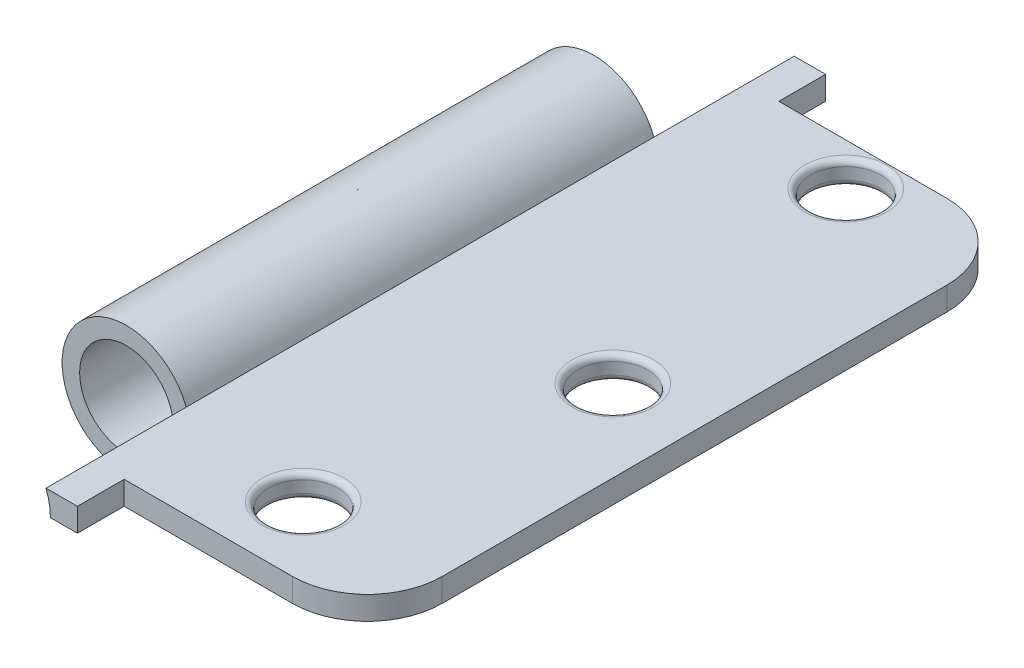
ISO-10303-21;
HEADER;
FILE_DESCRIPTION(('STEP AP214'),'2;1');
FILE_NAME('part.step','',(''),(''),'','','');
FILE_SCHEMA(('AUTOMOTIVE_DESIGN { 1 0 10303 214 1 1 1 1 }'));
ENDSEC;
DATA;
#1=APPLICATION_CONTEXT('core data for automotive mechanical design processes');
#2=APPLICATION_PROTOCOL_DEFINITION('international standard','automotive_design',2000,#1);
#3=PRODUCT_CONTEXT('',#1,'mechanical');
#4=PRODUCT('Part','Part','',(#3));
#5=PRODUCT_RELATED_PRODUCT_CATEGORY('part','',(#4));
#6=PRODUCT_DEFINITION_FORMATION('','',#4);
#7=PRODUCT_DEFINITION_CONTEXT('part definition',#1,'design');
#8=PRODUCT_DEFINITION('design','',#6,#7);
#9=PRODUCT_DEFINITION_SHAPE('','',#8);
#10=(LENGTH_UNIT() NAMED_UNIT(*) SI_UNIT(.MILLI.,.METRE.));
#11=(NAMED_UNIT(*) PLANE_ANGLE_UNIT() SI_UNIT($,.RADIAN.));
#12=(NAMED_UNIT(*) SI_UNIT($,.STERADIAN.) SOLID_ANGLE_UNIT());
#13=UNCERTAINTY_MEASURE_WITH_UNIT(LENGTH_MEASURE(1.E-05),#10,'distance_accuracy_value','');
#14=(GEOMETRIC_REPRESENTATION_CONTEXT(3) GLOBAL_UNCERTAINTY_ASSIGNED_CONTEXT((#13)) GLOBAL_UNIT_ASSIGNED_CONTEXT((#10,
#11,#12)) REPRESENTATION_CONTEXT('',''));
#15=CARTESIAN_POINT('',(0.,0.,0.));
#16=DIRECTION('',(0.,0.,1.));
#17=DIRECTION('',(1.,0.,0.));
#18=AXIS2_PLACEMENT_3D('',#15,#16,#17);
#19=CARTESIAN_POINT('',(-11.9822044674469,0.,50.8));
#20=DIRECTION('',(0.,0.,-1.));
#21=DIRECTION('',(-1.,0.,0.));
#22=AXIS2_PLACEMENT_3D('',#19,#20,#21);
#23=CYLINDRICAL_SURFACE('',#22,8.73125);
#24=CARTESIAN_POINT('',(-11.9822044674468,0.,-31.75));
#25=DIRECTION('',(0.,0.,-1.));
#26=DIRECTION('',(-1.,0.,0.));
#27=AXIS2_PLACEMENT_3D('',#24,#25,#26);
#28=CIRCLE('',#27,8.73124999999996);
#29=CARTESIAN_POINT('',(-3.25095446744689,0.,-31.75));
#30=VERTEX_POINT('',#29);
#31=CARTESIAN_POINT('',(-3.84868729696646,3.175,-31.75));
#32=VERTEX_POINT('',#31);
#33=EDGE_CURVE('E171',#30,#32,#28,.T.);
#34=ORIENTED_EDGE('',*,*,#33,.F.);
#35=DIRECTION('',(0.,0.,-1.));
#36=VECTOR('',#35,1.);
#37=CARTESIAN_POINT('',(-3.25095446744686,0.,50.8));
#38=LINE('',#37,#36);
#39=CARTESIAN_POINT('',(-3.25095446744686,0.,31.75));
#40=VERTEX_POINT('',#39);
#41=EDGE_CURVE('E193',#40,#30,#38,.T.);
#42=ORIENTED_EDGE('',*,*,#41,.F.);
#43=CARTESIAN_POINT('',(-11.9822044674469,0.,31.75));
#44=DIRECTION('',(0.,0.,1.));
#45=DIRECTION('',(1.,0.,0.));
#46=AXIS2_PLACEMENT_3D('',#43,#44,#45);
#47=CIRCLE('',#46,8.73125);
#48=CARTESIAN_POINT('',(-3.84868729696643,3.175,31.75));
#49=VERTEX_POINT('',#48);
#50=EDGE_CURVE('E184',#49,#40,#47,.T.);
#51=ORIENTED_EDGE('',*,*,#50,.F.);
#52=DIRECTION('',(0.,0.,-1.));
#53=VECTOR('',#52,1.);
#54=CARTESIAN_POINT('',(-3.84868729696643,3.175,50.8));
#55=LINE('',#54,#53);
#56=EDGE_CURVE('E190',#49,#32,#55,.T.);
#57=ORIENTED_EDGE('',*,*,#56,.T.);
#58=EDGE_LOOP('',(#34,#42,#51,#57));
#59=FACE_BOUND('',#58,.T.);
#60=ADVANCED_FACE('F42',(#59),#23,.T.);
#61=CARTESIAN_POINT('',(-11.9822044674469,0.,50.8));
#62=DIRECTION('',(0.,0.,-1.));
#63=DIRECTION('',(-1.,0.,0.));
#64=AXIS2_PLACEMENT_3D('',#61,#62,#63);
#65=CYLINDRICAL_SURFACE('',#64,6.35);
#66=CARTESIAN_POINT('',(-11.9822044674469,0.,31.75));
#67=DIRECTION('',(0.,0.,1.));
#68=DIRECTION('',(1.,0.,0.));
#69=AXIS2_PLACEMENT_3D('',#66,#67,#68);
#70=CIRCLE('',#69,6.35);
#71=CARTESIAN_POINT('',(-5.63220446744686,0.,31.75));
#72=VERTEX_POINT('',#71);
#73=EDGE_CURVE('E183',#72,#72,#70,.T.);
#74=ORIENTED_EDGE('',*,*,#73,.T.);
#75=EDGE_LOOP('',(#74));
#76=FACE_BOUND('',#75,.T.);
#77=CARTESIAN_POINT('',(-11.9822044674469,0.,-31.75));
#78=DIRECTION('',(0.,0.,-1.));
#79=DIRECTION('',(-1.,0.,0.));
#80=AXIS2_PLACEMENT_3D('',#77,#78,#79);
#81=CIRCLE('',#80,6.35);
#82=CARTESIAN_POINT('',(-18.3322044674469,0.,-31.75));
#83=VERTEX_POINT('',#82);
#84=EDGE_CURVE('E177',#83,#83,#81,.T.);
#85=ORIENTED_EDGE('',*,*,#84,.T.);
#86=EDGE_LOOP('',(#85));
#87=FACE_BOUND('',#86,.T.);
#88=ADVANCED_FACE('F291',(#76,#87),#65,.F.);
#89=CARTESIAN_POINT('',(23.273512,3.175,34.29));
#90=DIRECTION('',(0.,1.,0.));
#91=DIRECTION('',(0.,0.,1.));
#92=AXIS2_PLACEMENT_3D('',#89,#90,#91);
#93=PLANE('',#92);
#94=DIRECTION('',(-1.,0.,0.));
#95=VECTOR('',#94,1.);
#96=CARTESIAN_POINT('',(23.273512,3.175,-44.45));
#97=LINE('',#96,#95);
#98=CARTESIAN_POINT('',(23.273512,3.175,-44.45));
#99=VERTEX_POINT('',#98);
#100=CARTESIAN_POINT('',(0.413486599999999,3.175,-44.45));
#101=VERTEX_POINT('',#100);
#102=EDGE_CURVE('E204',#99,#101,#97,.T.);
#103=ORIENTED_EDGE('',*,*,#102,.T.);
#104=DIRECTION('',(0.,0.,1.));
#105=VECTOR('',#104,1.);
#106=CARTESIAN_POINT('',(0.4134866,3.175,-54.0018113886329));
#107=LINE('',#106,#105);
#108=CARTESIAN_POINT('',(0.4134866,3.175,-50.8));
#109=VERTEX_POINT('',#108);
#110=EDGE_CURVE('E161',#109,#101,#107,.T.);
#111=ORIENTED_EDGE('',*,*,#110,.F.);
#112=DIRECTION('',(1.,0.,0.));
#113=VECTOR('',#112,1.);
#114=CARTESIAN_POINT('',(0.,3.175,-50.8));
#115=LINE('',#114,#113);
#116=CARTESIAN_POINT('',(-3.84868729696643,3.175,-50.8));
#117=VERTEX_POINT('',#116);
#118=EDGE_CURVE('E141',#117,#109,#115,.T.);
#119=ORIENTED_EDGE('',*,*,#118,.F.);
#120=DIRECTION('',(0.,0.,-1.));
#121=VECTOR('',#120,1.);
#122=CARTESIAN_POINT('',(-3.84868729696646,3.175,-31.75));
#123=LINE('',#122,#121);
#124=EDGE_CURVE('E175',#32,#117,#123,.T.);
#125=ORIENTED_EDGE('',*,*,#124,.F.);
#126=ORIENTED_EDGE('',*,*,#56,.F.);
#127=CARTESIAN_POINT('',(-3.84868729696643,3.175,50.8));
#128=VERTEX_POINT('',#127);
#129=EDGE_CURVE('E191',#128,#49,#55,.T.);
#130=ORIENTED_EDGE('',*,*,#129,.F.);
#131=DIRECTION('',(-1.,0.,0.));
#132=VECTOR('',#131,1.);
#133=CARTESIAN_POINT('',(0.,3.175,50.8));
#134=LINE('',#133,#132);
#135=CARTESIAN_POINT('',(0.4134866,3.175,50.8));
#136=VERTEX_POINT('',#135);
#137=EDGE_CURVE('E140',#136,#128,#134,.T.);
#138=ORIENTED_EDGE('',*,*,#137,.F.);
#139=CARTESIAN_POINT('',(0.4134866,3.175,44.45));
#140=VERTEX_POINT('',#139);
#141=EDGE_CURVE('E156',#140,#136,#107,.T.);
#142=ORIENTED_EDGE('',*,*,#141,.F.);
#143=DIRECTION('',(1.,0.,0.));
#144=VECTOR('',#143,1.);
#145=CARTESIAN_POINT('',(0.,3.175,44.45));
#146=LINE('',#145,#144);
#147=CARTESIAN_POINT('',(23.273512,3.175,44.45));
#148=VERTEX_POINT('',#147);
#149=EDGE_CURVE('E206',#140,#148,#146,.T.);
#150=ORIENTED_EDGE('',*,*,#149,.T.);
#151=CARTESIAN_POINT('',(23.273512,3.175,34.29));
#152=DIRECTION('',(0.,1.,0.));
#153=DIRECTION('',(0.,0.,1.));
#154=AXIS2_PLACEMENT_3D('',#151,#152,#153);
#155=CIRCLE('',#154,10.16);
#156=CARTESIAN_POINT('',(33.433512,3.175,34.29));
#157=VERTEX_POINT('',#156);
#158=EDGE_CURVE('E197',#148,#157,#155,.T.);
#159=ORIENTED_EDGE('',*,*,#158,.T.);
#160=DIRECTION('',(0.,0.,-1.));
#161=VECTOR('',#160,1.);
#162=CARTESIAN_POINT('',(33.433512,3.175,34.29));
#163=LINE('',#162,#161);
#164=CARTESIAN_POINT('',(33.433512,3.175,-34.29));
#165=VERTEX_POINT('',#164);
#166=EDGE_CURVE('E200',#157,#165,#163,.T.);
#167=ORIENTED_EDGE('',*,*,#166,.T.);
#168=CARTESIAN_POINT('',(23.273512,3.175,-34.29));
#169=DIRECTION('',(0.,1.,0.));
#170=DIRECTION('',(0.,0.,1.));
#171=AXIS2_PLACEMENT_3D('',#168,#169,#170);
#172=CIRCLE('',#171,10.16);
#173=EDGE_CURVE('E202',#165,#99,#172,.T.);
#174=ORIENTED_EDGE('',*,*,#173,.T.);
#175=EDGE_LOOP('',(#103,#111,#119,#125,#126,#130,#138,#142,#150,#159,#167,#174));
#176=FACE_BOUND('',#175,.T.);
#177=CARTESIAN_POINT('',(22.321012,3.175,0.));
#178=DIRECTION('',(0.,1.,0.));
#179=DIRECTION('',(0.,0.,1.));
#180=AXIS2_PLACEMENT_3D('',#177,#178,#179);
#181=CIRCLE('',#180,5.55625);
#182=CARTESIAN_POINT('',(22.321012,3.175,5.55625));
#183=VERTEX_POINT('',#182);
#184=EDGE_CURVE('E50',#183,#183,#181,.F.);
#185=ORIENTED_EDGE('',*,*,#184,.T.);
#186=EDGE_LOOP('',(#185));
#187=FACE_BOUND('',#186,.T.);
#188=CARTESIAN_POINT('',(15.209012,3.175,-38.735));
#189=DIRECTION('',(0.,1.,0.));
#190=DIRECTION('',(0.,0.,1.));
#191=AXIS2_PLACEMENT_3D('',#188,#189,#190);
#192=CIRCLE('',#191,5.55625000000001);
#193=CARTESIAN_POINT('',(15.209012,3.175,-33.17875));
#194=VERTEX_POINT('',#193);
#195=EDGE_CURVE('E259',#194,#194,#192,.F.);
#196=ORIENTED_EDGE('',*,*,#195,.T.);
#197=EDGE_LOOP('',(#196));
#198=FACE_BOUND('',#197,.T.);
#199=CARTESIAN_POINT('',(15.209012,3.175,34.925));
#200=DIRECTION('',(0.,1.,0.));
#201=DIRECTION('',(0.,0.,1.));
#202=AXIS2_PLACEMENT_3D('',#199,#200,#201);
#203=CIRCLE('',#202,5.55625000000001);
#204=CARTESIAN_POINT('',(15.209012,3.175,40.48125));
#205=VERTEX_POINT('',#204);
#206=EDGE_CURVE('E256',#205,#205,#203,.F.);
#207=ORIENTED_EDGE('',*,*,#206,.T.);
#208=EDGE_LOOP('',(#207));
#209=FACE_BOUND('',#208,.T.);
#210=ADVANCED_FACE('F264',(#176,#187,#198,#209),#93,.T.);
#211=CARTESIAN_POINT('',(23.273512,0.,34.29));
#212=DIRECTION('',(0.,1.,0.));
#213=DIRECTION('',(0.,0.,1.));
#214=AXIS2_PLACEMENT_3D('',#211,#212,#213);
#215=PLANE('',#214);
#216=CARTESIAN_POINT('',(15.209012,0.,34.925));
#217=DIRECTION('',(0.,1.,0.));
#218=DIRECTION('',(0.,0.,1.));
#219=AXIS2_PLACEMENT_3D('',#216,#217,#218);
#220=CIRCLE('',#219,5.55625000000001);
#221=CARTESIAN_POINT('',(15.209012,0.,40.48125));
#222=VERTEX_POINT('',#221);
#223=EDGE_CURVE('E235',#222,#222,#220,.T.);
#224=ORIENTED_EDGE('',*,*,#223,.T.);
#225=EDGE_LOOP('',(#224));
#226=FACE_BOUND('',#225,.T.);
#227=CARTESIAN_POINT('',(15.209012,0.,-38.735));
#228=DIRECTION('',(0.,1.,0.));
#229=DIRECTION('',(0.,0.,1.));
#230=AXIS2_PLACEMENT_3D('',#227,#228,#229);
#231=CIRCLE('',#230,5.55625000000001);
#232=CARTESIAN_POINT('',(15.209012,0.,-33.17875));
#233=VERTEX_POINT('',#232);
#234=EDGE_CURVE('E232',#233,#233,#231,.T.);
#235=ORIENTED_EDGE('',*,*,#234,.T.);
#236=EDGE_LOOP('',(#235));
#237=FACE_BOUND('',#236,.T.);
#238=CARTESIAN_POINT('',(22.321012,0.,0.));
#239=DIRECTION('',(0.,1.,0.));
#240=DIRECTION('',(0.,0.,1.));
#241=AXIS2_PLACEMENT_3D('',#238,#239,#240);
#242=CIRCLE('',#241,5.55625);
#243=CARTESIAN_POINT('',(22.321012,0.,5.55625));
#244=VERTEX_POINT('',#243);
#245=EDGE_CURVE('E227',#244,#244,#242,.T.);
#246=ORIENTED_EDGE('',*,*,#245,.T.);
#247=EDGE_LOOP('',(#246));
#248=FACE_BOUND('',#247,.T.);
#249=DIRECTION('',(1.,0.,0.));
#250=VECTOR('',#249,1.);
#251=CARTESIAN_POINT('',(0.,0.,44.45));
#252=LINE('',#251,#250);
#253=CARTESIAN_POINT('',(0.4134866,0.,44.45));
#254=VERTEX_POINT('',#253);
#255=CARTESIAN_POINT('',(23.273512,0.,44.45));
#256=VERTEX_POINT('',#255);
#257=EDGE_CURVE('E148',#254,#256,#252,.T.);
#258=ORIENTED_EDGE('',*,*,#257,.F.);
#259=DIRECTION('',(0.,0.,1.));
#260=VECTOR('',#259,1.);
#261=CARTESIAN_POINT('',(0.4134866,0.,-54.0018113886329));
#262=LINE('',#261,#260);
#263=CARTESIAN_POINT('',(0.4134866,0.,50.8));
#264=VERTEX_POINT('',#263);
#265=EDGE_CURVE('E145',#254,#264,#262,.T.);
#266=ORIENTED_EDGE('',*,*,#265,.T.);
#267=DIRECTION('',(-1.,0.,0.));
#268=VECTOR('',#267,1.);
#269=CARTESIAN_POINT('',(0.,0.,50.8));
#270=LINE('',#269,#268);
#271=CARTESIAN_POINT('',(-3.25095446744686,0.,50.8));
#272=VERTEX_POINT('',#271);
#273=EDGE_CURVE('E131',#264,#272,#270,.T.);
#274=ORIENTED_EDGE('',*,*,#273,.T.);
#275=EDGE_CURVE('E194',#272,#40,#38,.T.);
#276=ORIENTED_EDGE('',*,*,#275,.T.);
#277=ORIENTED_EDGE('',*,*,#41,.T.);
#278=DIRECTION('',(0.,0.,-1.));
#279=VECTOR('',#278,1.);
#280=CARTESIAN_POINT('',(-3.25095446744689,0.,-31.75));
#281=LINE('',#280,#279);
#282=CARTESIAN_POINT('',(-3.2509544674469,0.,-50.8));
#283=VERTEX_POINT('',#282);
#284=EDGE_CURVE('E170',#30,#283,#281,.T.);
#285=ORIENTED_EDGE('',*,*,#284,.T.);
#286=DIRECTION('',(1.,0.,0.));
#287=VECTOR('',#286,1.);
#288=CARTESIAN_POINT('',(0.,0.,-50.8));
#289=LINE('',#288,#287);
#290=CARTESIAN_POINT('',(0.4134866,0.,-50.8));
#291=VERTEX_POINT('',#290);
#292=EDGE_CURVE('E187',#283,#291,#289,.T.);
#293=ORIENTED_EDGE('',*,*,#292,.T.);
#294=CARTESIAN_POINT('',(0.413486599999999,0.,-44.45));
#295=VERTEX_POINT('',#294);
#296=EDGE_CURVE('E151',#291,#295,#262,.T.);
#297=ORIENTED_EDGE('',*,*,#296,.T.);
#298=DIRECTION('',(-1.,0.,0.));
#299=VECTOR('',#298,1.);
#300=CARTESIAN_POINT('',(23.273512,0.,-44.45));
#301=LINE('',#300,#299);
#302=CARTESIAN_POINT('',(23.273512,0.,-44.45));
#303=VERTEX_POINT('',#302);
#304=EDGE_CURVE('E62',#303,#295,#301,.T.);
#305=ORIENTED_EDGE('',*,*,#304,.F.);
#306=CARTESIAN_POINT('',(23.273512,0.,-34.29));
#307=DIRECTION('',(0.,1.,0.));
#308=DIRECTION('',(0.,0.,1.));
#309=AXIS2_PLACEMENT_3D('',#306,#307,#308);
#310=CIRCLE('',#309,10.16);
#311=CARTESIAN_POINT('',(33.433512,0.,-34.29));
#312=VERTEX_POINT('',#311);
#313=EDGE_CURVE('E213',#312,#303,#310,.T.);
#314=ORIENTED_EDGE('',*,*,#313,.F.);
#315=DIRECTION('',(0.,0.,-1.));
#316=VECTOR('',#315,1.);
#317=CARTESIAN_POINT('',(33.433512,0.,34.29));
#318=LINE('',#317,#316);
#319=CARTESIAN_POINT('',(33.433512,0.,34.29));
#320=VERTEX_POINT('',#319);
#321=EDGE_CURVE('E211',#320,#312,#318,.T.);
#322=ORIENTED_EDGE('',*,*,#321,.F.);
#323=CARTESIAN_POINT('',(23.273512,0.,34.29));
#324=DIRECTION('',(0.,1.,0.));
#325=DIRECTION('',(0.,0.,1.));
#326=AXIS2_PLACEMENT_3D('',#323,#324,#325);
#327=CIRCLE('',#326,10.16);
#328=EDGE_CURVE('E196',#256,#320,#327,.T.);
#329=ORIENTED_EDGE('',*,*,#328,.F.);
#330=EDGE_LOOP('',(#258,#266,#274,#276,#277,#285,#293,#297,#305,#314,#322,#329));
#331=FACE_BOUND('',#330,.T.);
#332=ADVANCED_FACE('F146',(#226,#237,#248,#331),#215,.F.);
#333=CARTESIAN_POINT('',(23.273512,3.175,34.29));
#334=DIRECTION('',(0.,-1.,0.));
#335=DIRECTION('',(0.,0.,-1.));
#336=AXIS2_PLACEMENT_3D('',#333,#334,#335);
#337=CYLINDRICAL_SURFACE('',#336,10.16);
#338=ORIENTED_EDGE('',*,*,#328,.T.);
#339=DIRECTION('',(0.,-1.,0.));
#340=VECTOR('',#339,1.);
#341=CARTESIAN_POINT('',(33.433512,3.175,34.29));
#342=LINE('',#341,#340);
#343=EDGE_CURVE('E224',#157,#320,#342,.T.);
#344=ORIENTED_EDGE('',*,*,#343,.F.);
#345=ORIENTED_EDGE('',*,*,#158,.F.);
#346=DIRECTION('',(0.,-1.,0.));
#347=VECTOR('',#346,1.);
#348=CARTESIAN_POINT('',(23.273512,3.175,44.45));
#349=LINE('',#348,#347);
#350=EDGE_CURVE('E208',#148,#256,#349,.T.);
#351=ORIENTED_EDGE('',*,*,#350,.T.);
#352=EDGE_LOOP('',(#338,#344,#345,#351));
#353=FACE_BOUND('',#352,.T.);
#354=ADVANCED_FACE('F350',(#353),#337,.T.);
#355=CARTESIAN_POINT('',(33.433512,3.175,34.29));
#356=DIRECTION('',(-1.,0.,0.));
#357=DIRECTION('',(0.,0.,1.));
#358=AXIS2_PLACEMENT_3D('',#355,#356,#357);
#359=PLANE('',#358);
#360=ORIENTED_EDGE('',*,*,#321,.T.);
#361=DIRECTION('',(0.,-1.,0.));
#362=VECTOR('',#361,1.);
#363=CARTESIAN_POINT('',(33.433512,3.175,-34.29));
#364=LINE('',#363,#362);
#365=EDGE_CURVE('E221',#165,#312,#364,.T.);
#366=ORIENTED_EDGE('',*,*,#365,.F.);
#367=ORIENTED_EDGE('',*,*,#166,.F.);
#368=ORIENTED_EDGE('',*,*,#343,.T.);
#369=EDGE_LOOP('',(#360,#366,#367,#368));
#370=FACE_BOUND('',#369,.T.);
#371=ADVANCED_FACE('F347',(#370),#359,.F.);
#372=CARTESIAN_POINT('',(23.273512,3.175,-34.29));
#373=DIRECTION('',(0.,-1.,0.));
#374=DIRECTION('',(0.,0.,-1.));
#375=AXIS2_PLACEMENT_3D('',#372,#373,#374);
#376=CYLINDRICAL_SURFACE('',#375,10.16);
#377=ORIENTED_EDGE('',*,*,#313,.T.);
#378=DIRECTION('',(0.,-1.,0.));
#379=VECTOR('',#378,1.);
#380=CARTESIAN_POINT('',(23.273512,3.175,-44.45));
#381=LINE('',#380,#379);
#382=EDGE_CURVE('E219',#99,#303,#381,.T.);
#383=ORIENTED_EDGE('',*,*,#382,.F.);
#384=ORIENTED_EDGE('',*,*,#173,.F.);
#385=ORIENTED_EDGE('',*,*,#365,.T.);
#386=EDGE_LOOP('',(#377,#383,#384,#385));
#387=FACE_BOUND('',#386,.T.);
#388=ADVANCED_FACE('F343',(#387),#376,.T.);
#389=CARTESIAN_POINT('',(23.273512,3.175,-44.45));
#390=DIRECTION('',(0.,0.,1.));
#391=DIRECTION('',(1.,0.,0.));
#392=AXIS2_PLACEMENT_3D('',#389,#390,#391);
#393=PLANE('',#392);
#394=ORIENTED_EDGE('',*,*,#304,.T.);
#395=DIRECTION('',(0.,1.,0.));
#396=VECTOR('',#395,1.);
#397=CARTESIAN_POINT('',(0.413486599999999,3.175,-44.45));
#398=LINE('',#397,#396);
#399=EDGE_CURVE('E57',#295,#101,#398,.T.);
#400=ORIENTED_EDGE('',*,*,#399,.T.);
#401=ORIENTED_EDGE('',*,*,#102,.F.);
#402=ORIENTED_EDGE('',*,*,#382,.T.);
#403=EDGE_LOOP('',(#394,#400,#401,#402));
#404=FACE_BOUND('',#403,.T.);
#405=ADVANCED_FACE('F341',(#404),#393,.F.);
#406=CARTESIAN_POINT('',(0.,3.175,44.45));
#407=DIRECTION('',(0.,0.,-1.));
#408=DIRECTION('',(-1.,0.,0.));
#409=AXIS2_PLACEMENT_3D('',#406,#407,#408);
#410=PLANE('',#409);
#411=ORIENTED_EDGE('',*,*,#149,.F.);
#412=DIRECTION('',(0.,-1.,0.));
#413=VECTOR('',#412,1.);
#414=CARTESIAN_POINT('',(0.4134866,3.175,44.45));
#415=LINE('',#414,#413);
#416=EDGE_CURVE('E12',#140,#254,#415,.T.);
#417=ORIENTED_EDGE('',*,*,#416,.T.);
#418=ORIENTED_EDGE('',*,*,#257,.T.);
#419=ORIENTED_EDGE('',*,*,#350,.F.);
#420=EDGE_LOOP('',(#411,#417,#418,#419));
#421=FACE_BOUND('',#420,.T.);
#422=ADVANCED_FACE('F353',(#421),#410,.F.);
#423=CARTESIAN_POINT('',(15.209012,3.175,-38.735));
#424=DIRECTION('',(0.,-1.,0.));
#425=DIRECTION('',(0.,0.,-1.));
#426=AXIS2_PLACEMENT_3D('',#423,#424,#425);
#427=CYLINDRICAL_SURFACE('',#426,4.76250000000001);
#428=CARTESIAN_POINT('',(15.209012,0.79375,-38.735));
#429=DIRECTION('',(0.,1.,0.));
#430=DIRECTION('',(0.,0.,1.));
#431=AXIS2_PLACEMENT_3D('',#428,#429,#430);
#432=CIRCLE('',#431,4.76250000000001);
#433=CARTESIAN_POINT('',(15.209012,0.79375,-33.9725));
#434=VERTEX_POINT('',#433);
#435=EDGE_CURVE('E247',#434,#434,#432,.F.);
#436=ORIENTED_EDGE('',*,*,#435,.T.);
#437=EDGE_LOOP('',(#436));
#438=FACE_BOUND('',#437,.T.);
#439=CARTESIAN_POINT('',(15.209012,2.38125,-38.735));
#440=DIRECTION('',(0.,1.,0.));
#441=DIRECTION('',(0.,0.,1.));
#442=AXIS2_PLACEMENT_3D('',#439,#440,#441);
#443=CIRCLE('',#442,4.76250000000001);
#444=CARTESIAN_POINT('',(15.209012,2.38125,-33.9725));
#445=VERTEX_POINT('',#444);
#446=EDGE_CURVE('E244',#445,#445,#443,.T.);
#447=ORIENTED_EDGE('',*,*,#446,.T.);
#448=EDGE_LOOP('',(#447));
#449=FACE_BOUND('',#448,.T.);
#450=ADVANCED_FACE('F286',(#438,#449),#427,.F.);
#451=CARTESIAN_POINT('',(15.209012,3.175,34.925));
#452=DIRECTION('',(0.,-1.,0.));
#453=DIRECTION('',(0.,0.,-1.));
#454=AXIS2_PLACEMENT_3D('',#451,#452,#453);
#455=CYLINDRICAL_SURFACE('',#454,4.76250000000001);
#456=CARTESIAN_POINT('',(15.209012,0.79375,34.925));
#457=DIRECTION('',(0.,1.,0.));
#458=DIRECTION('',(0.,0.,1.));
#459=AXIS2_PLACEMENT_3D('',#456,#457,#458);
#460=CIRCLE('',#459,4.76250000000001);
#461=CARTESIAN_POINT('',(15.209012,0.79375,39.6875));
#462=VERTEX_POINT('',#461);
#463=EDGE_CURVE('E241',#462,#462,#460,.F.);
#464=ORIENTED_EDGE('',*,*,#463,.T.);
#465=EDGE_LOOP('',(#464));
#466=FACE_BOUND('',#465,.T.);
#467=CARTESIAN_POINT('',(15.209012,2.38125,34.925));
#468=DIRECTION('',(0.,1.,0.));
#469=DIRECTION('',(0.,0.,1.));
#470=AXIS2_PLACEMENT_3D('',#467,#468,#469);
#471=CIRCLE('',#470,4.76250000000001);
#472=CARTESIAN_POINT('',(15.209012,2.38125,39.6875));
#473=VERTEX_POINT('',#472);
#474=EDGE_CURVE('E238',#473,#473,#471,.T.);
#475=ORIENTED_EDGE('',*,*,#474,.T.);
#476=EDGE_LOOP('',(#475));
#477=FACE_BOUND('',#476,.T.);
#478=ADVANCED_FACE('F277',(#466,#477),#455,.F.);
#479=CARTESIAN_POINT('',(22.321012,3.175,0.));
#480=DIRECTION('',(0.,-1.,0.));
#481=DIRECTION('',(0.,0.,-1.));
#482=AXIS2_PLACEMENT_3D('',#479,#480,#481);
#483=CYLINDRICAL_SURFACE('',#482,4.7625);
#484=CARTESIAN_POINT('',(22.321012,0.79375,0.));
#485=DIRECTION('',(0.,1.,0.));
#486=DIRECTION('',(0.,0.,1.));
#487=AXIS2_PLACEMENT_3D('',#484,#485,#486);
#488=CIRCLE('',#487,4.7625);
#489=CARTESIAN_POINT('',(22.321012,0.79375,4.7625));
#490=VERTEX_POINT('',#489);
#491=EDGE_CURVE('E253',#490,#490,#488,.F.);
#492=ORIENTED_EDGE('',*,*,#491,.T.);
#493=EDGE_LOOP('',(#492));
#494=FACE_BOUND('',#493,.T.);
#495=CARTESIAN_POINT('',(22.321012,2.38125,0.));
#496=DIRECTION('',(0.,1.,0.));
#497=DIRECTION('',(0.,0.,1.));
#498=AXIS2_PLACEMENT_3D('',#495,#496,#497);
#499=CIRCLE('',#498,4.7625);
#500=CARTESIAN_POINT('',(22.321012,2.38125,4.7625));
#501=VERTEX_POINT('',#500);
#502=EDGE_CURVE('E250',#501,#501,#499,.T.);
#503=ORIENTED_EDGE('',*,*,#502,.T.);
#504=EDGE_LOOP('',(#503));
#505=FACE_BOUND('',#504,.T.);
#506=ADVANCED_FACE('F275',(#494,#505),#483,.F.);
#507=CARTESIAN_POINT('',(0.,0.,50.8));
#508=DIRECTION('',(0.,0.,1.));
#509=DIRECTION('',(1.,0.,0.));
#510=AXIS2_PLACEMENT_3D('',#507,#508,#509);
#511=PLANE('',#510);
#512=CARTESIAN_POINT('',(-11.9822044674469,0.,50.8));
#513=DIRECTION('',(0.,0.,1.));
#514=DIRECTION('',(1.,0.,0.));
#515=AXIS2_PLACEMENT_3D('',#512,#513,#514);
#516=CIRCLE('',#515,8.73125);
#517=EDGE_CURVE('E137',#272,#128,#516,.T.);
#518=ORIENTED_EDGE('',*,*,#517,.F.);
#519=ORIENTED_EDGE('',*,*,#273,.F.);
#520=DIRECTION('',(0.,1.,0.));
#521=VECTOR('',#520,1.);
#522=CARTESIAN_POINT('',(0.4134866,3.175,50.8));
#523=LINE('',#522,#521);
#524=EDGE_CURVE('E136',#264,#136,#523,.T.);
#525=ORIENTED_EDGE('',*,*,#524,.T.);
#526=ORIENTED_EDGE('',*,*,#137,.T.);
#527=EDGE_LOOP('',(#518,#519,#525,#526));
#528=FACE_BOUND('',#527,.T.);
#529=ADVANCED_FACE('F133',(#528),#511,.T.);
#530=CARTESIAN_POINT('',(23.273512,3.175,-50.8));
#531=DIRECTION('',(0.,0.,1.));
#532=DIRECTION('',(1.,0.,0.));
#533=AXIS2_PLACEMENT_3D('',#530,#531,#532);
#534=PLANE('',#533);
#535=ORIENTED_EDGE('',*,*,#292,.F.);
#536=CARTESIAN_POINT('',(-11.9822044674469,0.,-50.8));
#537=DIRECTION('',(0.,0.,-1.));
#538=DIRECTION('',(-1.,0.,0.));
#539=AXIS2_PLACEMENT_3D('',#536,#537,#538);
#540=CIRCLE('',#539,8.73124999999996);
#541=EDGE_CURVE('E166',#117,#283,#540,.T.);
#542=ORIENTED_EDGE('',*,*,#541,.F.);
#543=ORIENTED_EDGE('',*,*,#118,.T.);
#544=DIRECTION('',(0.,-1.,0.));
#545=VECTOR('',#544,1.);
#546=CARTESIAN_POINT('',(0.4134866,3.175,-50.8));
#547=LINE('',#546,#545);
#548=EDGE_CURVE('E160',#109,#291,#547,.T.);
#549=ORIENTED_EDGE('',*,*,#548,.T.);
#550=EDGE_LOOP('',(#535,#542,#543,#549));
#551=FACE_BOUND('',#550,.T.);
#552=ADVANCED_FACE('F284',(#551),#534,.F.);
#553=CARTESIAN_POINT('',(-11.9822044674469,0.,31.75));
#554=DIRECTION('',(0.,0.,1.));
#555=DIRECTION('',(1.,0.,0.));
#556=AXIS2_PLACEMENT_3D('',#553,#554,#555);
#557=CYLINDRICAL_SURFACE('',#556,8.73125);
#558=ORIENTED_EDGE('',*,*,#129,.T.);
#559=EDGE_CURVE('E180',#40,#49,#47,.T.);
#560=ORIENTED_EDGE('',*,*,#559,.F.);
#561=ORIENTED_EDGE('',*,*,#275,.F.);
#562=ORIENTED_EDGE('',*,*,#517,.T.);
#563=EDGE_LOOP('',(#558,#560,#561,#562));
#564=FACE_BOUND('',#563,.T.);
#565=ADVANCED_FACE('F302',(#564),#557,.F.);
#566=CARTESIAN_POINT('',(-11.9822044674469,0.,31.75));
#567=DIRECTION('',(0.,0.,1.));
#568=DIRECTION('',(1.,0.,0.));
#569=AXIS2_PLACEMENT_3D('',#566,#567,#568);
#570=PLANE('',#569);
#571=ORIENTED_EDGE('',*,*,#73,.F.);
#572=EDGE_LOOP('',(#571));
#573=FACE_BOUND('',#572,.T.);
#574=ORIENTED_EDGE('',*,*,#559,.T.);
#575=ORIENTED_EDGE('',*,*,#50,.T.);
#576=EDGE_LOOP('',(#574,#575));
#577=FACE_BOUND('',#576,.T.);
#578=ADVANCED_FACE('F306',(#573,#577),#570,.T.);
#579=CARTESIAN_POINT('',(-11.9822044674468,0.,-31.75));
#580=DIRECTION('',(0.,0.,-1.));
#581=DIRECTION('',(-1.,0.,0.));
#582=AXIS2_PLACEMENT_3D('',#579,#580,#581);
#583=CYLINDRICAL_SURFACE('',#582,8.73124999999996);
#584=ORIENTED_EDGE('',*,*,#124,.T.);
#585=ORIENTED_EDGE('',*,*,#541,.T.);
#586=ORIENTED_EDGE('',*,*,#284,.F.);
#587=EDGE_CURVE('E167',#32,#30,#28,.T.);
#588=ORIENTED_EDGE('',*,*,#587,.F.);
#589=EDGE_LOOP('',(#584,#585,#586,#588));
#590=FACE_BOUND('',#589,.T.);
#591=ADVANCED_FACE('F310',(#590),#583,.F.);
#592=CARTESIAN_POINT('',(-11.9822044674468,0.,-31.75));
#593=DIRECTION('',(0.,0.,-1.));
#594=DIRECTION('',(-1.,0.,0.));
#595=AXIS2_PLACEMENT_3D('',#592,#593,#594);
#596=PLANE('',#595);
#597=ORIENTED_EDGE('',*,*,#84,.F.);
#598=EDGE_LOOP('',(#597));
#599=FACE_BOUND('',#598,.T.);
#600=ORIENTED_EDGE('',*,*,#587,.T.);
#601=ORIENTED_EDGE('',*,*,#33,.T.);
#602=EDGE_LOOP('',(#600,#601));
#603=FACE_BOUND('',#602,.T.);
#604=ADVANCED_FACE('F314',(#599,#603),#596,.T.);
#605=CARTESIAN_POINT('',(15.209012,0.79375,34.925));
#606=DIRECTION('',(0.,1.,0.));
#607=DIRECTION('',(0.,0.,1.));
#608=AXIS2_PLACEMENT_3D('',#605,#606,#607);
#609=TOROIDAL_SURFACE('',#608,5.55625000000001,0.79375);
#610=ORIENTED_EDGE('',*,*,#463,.F.);
#611=EDGE_LOOP('',(#610));
#612=FACE_BOUND('',#611,.T.);
#613=ORIENTED_EDGE('',*,*,#223,.F.);
#614=EDGE_LOOP('',(#613));
#615=FACE_BOUND('',#614,.T.);
#616=ADVANCED_FACE('F318',(#612,#615),#609,.T.);
#617=CARTESIAN_POINT('',(15.209012,0.79375,-38.735));
#618=DIRECTION('',(0.,1.,0.));
#619=DIRECTION('',(0.,0.,1.));
#620=AXIS2_PLACEMENT_3D('',#617,#618,#619);
#621=TOROIDAL_SURFACE('',#620,5.55625000000001,0.79375);
#622=ORIENTED_EDGE('',*,*,#435,.F.);
#623=EDGE_LOOP('',(#622));
#624=FACE_BOUND('',#623,.T.);
#625=ORIENTED_EDGE('',*,*,#234,.F.);
#626=EDGE_LOOP('',(#625));
#627=FACE_BOUND('',#626,.T.);
#628=ADVANCED_FACE('F383',(#624,#627),#621,.T.);
#629=CARTESIAN_POINT('',(22.321012,0.79375,0.));
#630=DIRECTION('',(0.,1.,0.));
#631=DIRECTION('',(0.,0.,1.));
#632=AXIS2_PLACEMENT_3D('',#629,#630,#631);
#633=TOROIDAL_SURFACE('',#632,5.55625,0.79375);
#634=ORIENTED_EDGE('',*,*,#491,.F.);
#635=EDGE_LOOP('',(#634));
#636=FACE_BOUND('',#635,.T.);
#637=ORIENTED_EDGE('',*,*,#245,.F.);
#638=EDGE_LOOP('',(#637));
#639=FACE_BOUND('',#638,.T.);
#640=ADVANCED_FACE('F271',(#636,#639),#633,.T.);
#641=CARTESIAN_POINT('',(22.321012,2.38125,0.));
#642=DIRECTION('',(0.,1.,0.));
#643=DIRECTION('',(0.,0.,1.));
#644=AXIS2_PLACEMENT_3D('',#641,#642,#643);
#645=TOROIDAL_SURFACE('',#644,5.55625,0.79375);
#646=ORIENTED_EDGE('',*,*,#184,.F.);
#647=EDGE_LOOP('',(#646));
#648=FACE_BOUND('',#647,.T.);
#649=ORIENTED_EDGE('',*,*,#502,.F.);
#650=EDGE_LOOP('',(#649));
#651=FACE_BOUND('',#650,.T.);
#652=ADVANCED_FACE('F267',(#648,#651),#645,.T.);
#653=CARTESIAN_POINT('',(15.209012,2.38125,-38.735));
#654=DIRECTION('',(0.,1.,0.));
#655=DIRECTION('',(0.,0.,1.));
#656=AXIS2_PLACEMENT_3D('',#653,#654,#655);
#657=TOROIDAL_SURFACE('',#656,5.55625000000001,0.79375);
#658=ORIENTED_EDGE('',*,*,#195,.F.);
#659=EDGE_LOOP('',(#658));
#660=FACE_BOUND('',#659,.T.);
#661=ORIENTED_EDGE('',*,*,#446,.F.);
#662=EDGE_LOOP('',(#661));
#663=FACE_BOUND('',#662,.T.);
#664=ADVANCED_FACE('F270',(#660,#663),#657,.T.);
#665=CARTESIAN_POINT('',(15.209012,2.38125,34.925));
#666=DIRECTION('',(0.,1.,0.));
#667=DIRECTION('',(0.,0.,1.));
#668=AXIS2_PLACEMENT_3D('',#665,#666,#667);
#669=TOROIDAL_SURFACE('',#668,5.55625000000001,0.79375);
#670=ORIENTED_EDGE('',*,*,#206,.F.);
#671=EDGE_LOOP('',(#670));
#672=FACE_BOUND('',#671,.T.);
#673=ORIENTED_EDGE('',*,*,#474,.F.);
#674=EDGE_LOOP('',(#673));
#675=FACE_BOUND('',#674,.T.);
#676=ADVANCED_FACE('F44',(#672,#675),#669,.T.);
#677=CARTESIAN_POINT('',(0.4134866,3.175,-54.0018113886329));
#678=DIRECTION('',(1.,0.,0.));
#679=DIRECTION('',(0.,1.,0.));
#680=AXIS2_PLACEMENT_3D('',#677,#678,#679);
#681=PLANE('',#680);
#682=ORIENTED_EDGE('',*,*,#399,.F.);
#683=ORIENTED_EDGE('',*,*,#296,.F.);
#684=ORIENTED_EDGE('',*,*,#548,.F.);
#685=ORIENTED_EDGE('',*,*,#110,.T.);
#686=EDGE_LOOP('',(#682,#683,#684,#685));
#687=FACE_BOUND('',#686,.T.);
#688=ADVANCED_FACE('F320',(#687),#681,.T.);
#689=ORIENTED_EDGE('',*,*,#416,.F.);
#690=ORIENTED_EDGE('',*,*,#141,.T.);
#691=ORIENTED_EDGE('',*,*,#524,.F.);
#692=ORIENTED_EDGE('',*,*,#265,.F.);
#693=EDGE_LOOP('',(#689,#690,#691,#692));
#694=FACE_BOUND('',#693,.T.);
#695=ADVANCED_FACE('F154',(#694),#681,.T.);
#696=CLOSED_SHELL('',(#60,#88,#210,#332,#354,#371,#388,#405,#422,#450,#478,#506,#529,#552,#565,
#578,#591,#604,#616,#628,#640,#652,#664,#676,#688,#695));
#697=MANIFOLD_SOLID_BREP('B2',#696);
#698=ADVANCED_BREP_SHAPE_REPRESENTATION('',(#18,#697),#14);
#699=SHAPE_DEFINITION_REPRESENTATION(#9,#698);
ENDSEC;
END-ISO-10303-21;
